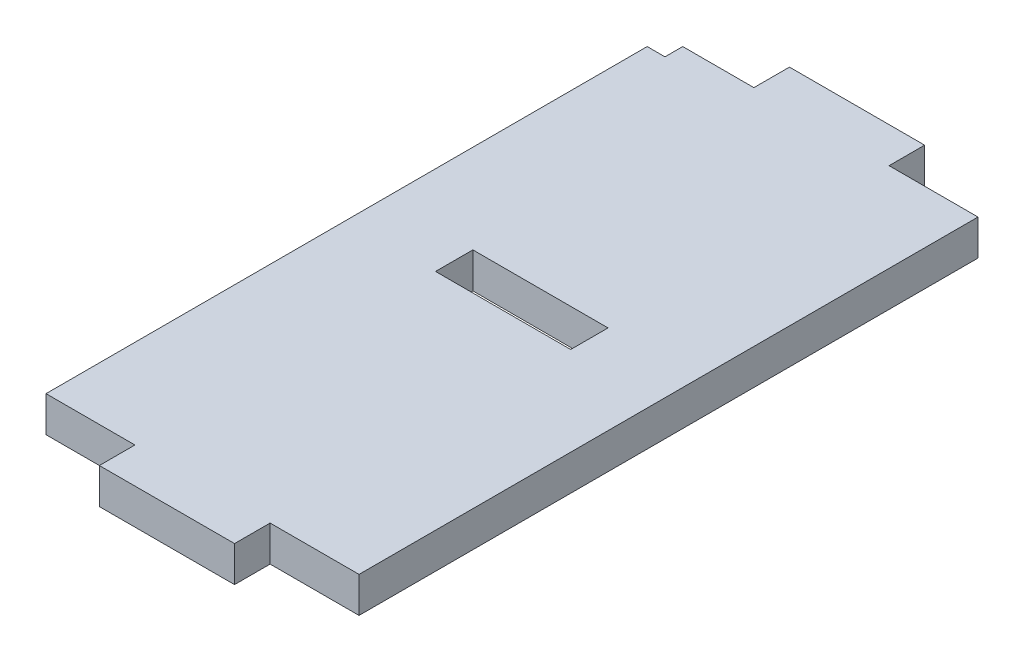
ISO-10303-21;
HEADER;
FILE_DESCRIPTION(('STEP AP214'),'2;1');
FILE_NAME('part.step','',(''),(''),'','','');
FILE_SCHEMA(('AUTOMOTIVE_DESIGN { 1 0 10303 214 1 1 1 1 }'));
ENDSEC;
DATA;
#1=APPLICATION_CONTEXT('core data for automotive mechanical design processes');
#2=APPLICATION_PROTOCOL_DEFINITION('international standard','automotive_design',2000,#1);
#3=PRODUCT_CONTEXT('',#1,'mechanical');
#4=PRODUCT('Part','Part','',(#3));
#5=PRODUCT_RELATED_PRODUCT_CATEGORY('part','',(#4));
#6=PRODUCT_DEFINITION_FORMATION('','',#4);
#7=PRODUCT_DEFINITION_CONTEXT('part definition',#1,'design');
#8=PRODUCT_DEFINITION('design','',#6,#7);
#9=PRODUCT_DEFINITION_SHAPE('','',#8);
#10=(LENGTH_UNIT() NAMED_UNIT(*) SI_UNIT(.MILLI.,.METRE.));
#11=(NAMED_UNIT(*) PLANE_ANGLE_UNIT() SI_UNIT($,.RADIAN.));
#12=(NAMED_UNIT(*) SI_UNIT($,.STERADIAN.) SOLID_ANGLE_UNIT());
#13=UNCERTAINTY_MEASURE_WITH_UNIT(LENGTH_MEASURE(1.E-05),#10,'distance_accuracy_value','');
#14=(GEOMETRIC_REPRESENTATION_CONTEXT(3) GLOBAL_UNCERTAINTY_ASSIGNED_CONTEXT((#13)) GLOBAL_UNIT_ASSIGNED_CONTEXT((#10,
#11,#12)) REPRESENTATION_CONTEXT('',''));
#15=CARTESIAN_POINT('',(0.,0.,0.));
#16=DIRECTION('',(0.,0.,1.));
#17=DIRECTION('',(1.,0.,0.));
#18=AXIS2_PLACEMENT_3D('',#15,#16,#17);
#19=CARTESIAN_POINT('',(0.,2.,-34.8));
#20=DIRECTION('',(0.,0.,-1.));
#21=DIRECTION('',(-1.,0.,0.));
#22=AXIS2_PLACEMENT_3D('',#19,#20,#21);
#23=PLANE('',#22);
#24=DIRECTION('',(1.,0.,0.));
#25=VECTOR('',#24,1.);
#26=CARTESIAN_POINT('',(0.,0.,-34.8));
#27=LINE('',#26,#25);
#28=CARTESIAN_POINT('',(1.,0.,-34.8));
#29=VERTEX_POINT('',#28);
#30=CARTESIAN_POINT('',(5.,0.,-34.8));
#31=VERTEX_POINT('',#30);
#32=EDGE_CURVE('E208',#29,#31,#27,.T.);
#33=ORIENTED_EDGE('',*,*,#32,.F.);
#34=DIRECTION('',(0.,-1.,0.));
#35=VECTOR('',#34,1.);
#36=CARTESIAN_POINT('',(1.,2.,-34.8));
#37=LINE('',#36,#35);
#38=CARTESIAN_POINT('',(1.,2.,-34.8));
#39=VERTEX_POINT('',#38);
#40=EDGE_CURVE('E11',#39,#29,#37,.T.);
#41=ORIENTED_EDGE('',*,*,#40,.F.);
#42=DIRECTION('',(1.,0.,0.));
#43=VECTOR('',#42,1.);
#44=CARTESIAN_POINT('',(0.,2.,-34.8));
#45=LINE('',#44,#43);
#46=CARTESIAN_POINT('',(5.,2.,-34.8));
#47=VERTEX_POINT('',#46);
#48=EDGE_CURVE('E321',#39,#47,#45,.T.);
#49=ORIENTED_EDGE('',*,*,#48,.T.);
#50=DIRECTION('',(0.,-1.,0.));
#51=VECTOR('',#50,1.);
#52=CARTESIAN_POINT('',(5.,2.,-34.8));
#53=LINE('',#52,#51);
#54=EDGE_CURVE('E118',#47,#31,#53,.T.);
#55=ORIENTED_EDGE('',*,*,#54,.T.);
#56=EDGE_LOOP('',(#33,#41,#49,#55));
#57=FACE_BOUND('',#56,.T.);
#58=ADVANCED_FACE('F35',(#57),#23,.T.);
#59=CARTESIAN_POINT('',(1.00000000000001,2.,0.));
#60=DIRECTION('',(1.,0.,0.));
#61=DIRECTION('',(0.,0.,-1.));
#62=AXIS2_PLACEMENT_3D('',#59,#60,#61);
#63=PLANE('',#62);
#64=DIRECTION('',(0.,0.,1.));
#65=VECTOR('',#64,1.);
#66=CARTESIAN_POINT('',(1.00000000000001,0.,0.));
#67=LINE('',#66,#65);
#68=CARTESIAN_POINT('',(1.,0.,-33.8));
#69=VERTEX_POINT('',#68);
#70=EDGE_CURVE('E211',#29,#69,#67,.T.);
#71=ORIENTED_EDGE('',*,*,#70,.T.);
#72=DIRECTION('',(0.,-1.,0.));
#73=VECTOR('',#72,1.);
#74=CARTESIAN_POINT('',(1.,2.,-33.8));
#75=LINE('',#74,#73);
#76=CARTESIAN_POINT('',(1.,2.,-33.8));
#77=VERTEX_POINT('',#76);
#78=EDGE_CURVE('E45',#77,#69,#75,.T.);
#79=ORIENTED_EDGE('',*,*,#78,.F.);
#80=DIRECTION('',(0.,0.,1.));
#81=VECTOR('',#80,1.);
#82=CARTESIAN_POINT('',(1.00000000000001,2.,0.));
#83=LINE('',#82,#81);
#84=EDGE_CURVE('E323',#39,#77,#83,.T.);
#85=ORIENTED_EDGE('',*,*,#84,.F.);
#86=ORIENTED_EDGE('',*,*,#40,.T.);
#87=EDGE_LOOP('',(#71,#79,#85,#86));
#88=FACE_BOUND('',#87,.T.);
#89=ADVANCED_FACE('F297',(#88),#63,.F.);
#90=CARTESIAN_POINT('',(0.,2.,-33.8));
#91=DIRECTION('',(0.,0.,-1.));
#92=DIRECTION('',(-1.,0.,0.));
#93=AXIS2_PLACEMENT_3D('',#90,#91,#92);
#94=PLANE('',#93);
#95=DIRECTION('',(1.,0.,0.));
#96=VECTOR('',#95,1.);
#97=CARTESIAN_POINT('',(0.,0.,-33.8));
#98=LINE('',#97,#96);
#99=CARTESIAN_POINT('',(0.,0.,-33.8));
#100=VERTEX_POINT('',#99);
#101=EDGE_CURVE('E215',#100,#69,#98,.T.);
#102=ORIENTED_EDGE('',*,*,#101,.F.);
#103=DIRECTION('',(0.,-1.,0.));
#104=VECTOR('',#103,1.);
#105=CARTESIAN_POINT('',(0.,2.,-33.8));
#106=LINE('',#105,#104);
#107=CARTESIAN_POINT('',(0.,2.,-33.8));
#108=VERTEX_POINT('',#107);
#109=EDGE_CURVE('E263',#108,#100,#106,.T.);
#110=ORIENTED_EDGE('',*,*,#109,.F.);
#111=DIRECTION('',(1.,0.,0.));
#112=VECTOR('',#111,1.);
#113=CARTESIAN_POINT('',(0.,2.,-33.8));
#114=LINE('',#113,#112);
#115=EDGE_CURVE('E325',#108,#77,#114,.T.);
#116=ORIENTED_EDGE('',*,*,#115,.T.);
#117=ORIENTED_EDGE('',*,*,#78,.T.);
#118=EDGE_LOOP('',(#102,#110,#116,#117));
#119=FACE_BOUND('',#118,.T.);
#120=ADVANCED_FACE('F303',(#119),#94,.T.);
#121=CARTESIAN_POINT('',(0.,2.,0.));
#122=DIRECTION('',(-1.,0.,0.));
#123=DIRECTION('',(0.,0.,1.));
#124=AXIS2_PLACEMENT_3D('',#121,#122,#123);
#125=PLANE('',#124);
#126=DIRECTION('',(0.,0.,-1.));
#127=VECTOR('',#126,1.);
#128=CARTESIAN_POINT('',(0.,0.,0.));
#129=LINE('',#128,#127);
#130=CARTESIAN_POINT('',(0.,0.,0.));
#131=VERTEX_POINT('',#130);
#132=EDGE_CURVE('E218',#131,#100,#129,.T.);
#133=ORIENTED_EDGE('',*,*,#132,.F.);
#134=DIRECTION('',(0.,-1.,0.));
#135=VECTOR('',#134,1.);
#136=CARTESIAN_POINT('',(0.,2.,0.));
#137=LINE('',#136,#135);
#138=CARTESIAN_POINT('',(0.,2.,0.));
#139=VERTEX_POINT('',#138);
#140=EDGE_CURVE('E261',#139,#131,#137,.T.);
#141=ORIENTED_EDGE('',*,*,#140,.F.);
#142=DIRECTION('',(0.,0.,-1.));
#143=VECTOR('',#142,1.);
#144=CARTESIAN_POINT('',(0.,2.,0.));
#145=LINE('',#144,#143);
#146=EDGE_CURVE('E344',#139,#108,#145,.T.);
#147=ORIENTED_EDGE('',*,*,#146,.T.);
#148=ORIENTED_EDGE('',*,*,#109,.T.);
#149=EDGE_LOOP('',(#133,#141,#147,#148));
#150=FACE_BOUND('',#149,.T.);
#151=ADVANCED_FACE('F355',(#150),#125,.T.);
#152=CARTESIAN_POINT('',(0.,2.,0.));
#153=DIRECTION('',(0.,0.,-1.));
#154=DIRECTION('',(-1.,0.,0.));
#155=AXIS2_PLACEMENT_3D('',#152,#153,#154);
#156=PLANE('',#155);
#157=DIRECTION('',(1.,0.,0.));
#158=VECTOR('',#157,1.);
#159=CARTESIAN_POINT('',(0.,0.,0.));
#160=LINE('',#159,#158);
#161=CARTESIAN_POINT('',(5.,0.,0.));
#162=VERTEX_POINT('',#161);
#163=EDGE_CURVE('E221',#131,#162,#160,.T.);
#164=ORIENTED_EDGE('',*,*,#163,.T.);
#165=DIRECTION('',(0.,-1.,0.));
#166=VECTOR('',#165,1.);
#167=CARTESIAN_POINT('',(5.,2.,0.));
#168=LINE('',#167,#166);
#169=CARTESIAN_POINT('',(5.,2.,0.));
#170=VERTEX_POINT('',#169);
#171=EDGE_CURVE('E258',#170,#162,#168,.T.);
#172=ORIENTED_EDGE('',*,*,#171,.F.);
#173=DIRECTION('',(1.,0.,0.));
#174=VECTOR('',#173,1.);
#175=CARTESIAN_POINT('',(0.,2.,0.));
#176=LINE('',#175,#174);
#177=EDGE_CURVE('E334',#139,#170,#176,.T.);
#178=ORIENTED_EDGE('',*,*,#177,.F.);
#179=ORIENTED_EDGE('',*,*,#140,.T.);
#180=EDGE_LOOP('',(#164,#172,#178,#179));
#181=FACE_BOUND('',#180,.T.);
#182=ADVANCED_FACE('F360',(#181),#156,.F.);
#183=CARTESIAN_POINT('',(5.,2.,0.));
#184=DIRECTION('',(1.,0.,0.));
#185=DIRECTION('',(0.,0.,-1.));
#186=AXIS2_PLACEMENT_3D('',#183,#184,#185);
#187=PLANE('',#186);
#188=DIRECTION('',(0.,0.,1.));
#189=VECTOR('',#188,1.);
#190=CARTESIAN_POINT('',(5.,0.,0.));
#191=LINE('',#190,#189);
#192=CARTESIAN_POINT('',(5.,0.,2.));
#193=VERTEX_POINT('',#192);
#194=EDGE_CURVE('E224',#162,#193,#191,.T.);
#195=ORIENTED_EDGE('',*,*,#194,.T.);
#196=DIRECTION('',(0.,-1.,0.));
#197=VECTOR('',#196,1.);
#198=CARTESIAN_POINT('',(5.,2.,2.));
#199=LINE('',#198,#197);
#200=CARTESIAN_POINT('',(5.,2.,2.));
#201=VERTEX_POINT('',#200);
#202=EDGE_CURVE('E255',#201,#193,#199,.T.);
#203=ORIENTED_EDGE('',*,*,#202,.F.);
#204=DIRECTION('',(0.,0.,1.));
#205=VECTOR('',#204,1.);
#206=CARTESIAN_POINT('',(5.,2.,0.));
#207=LINE('',#206,#205);
#208=EDGE_CURVE('E340',#170,#201,#207,.T.);
#209=ORIENTED_EDGE('',*,*,#208,.F.);
#210=ORIENTED_EDGE('',*,*,#171,.T.);
#211=EDGE_LOOP('',(#195,#203,#209,#210));
#212=FACE_BOUND('',#211,.T.);
#213=ADVANCED_FACE('F365',(#212),#187,.F.);
#214=CARTESIAN_POINT('',(0.,2.,2.));
#215=DIRECTION('',(0.,0.,-1.));
#216=DIRECTION('',(-1.,0.,0.));
#217=AXIS2_PLACEMENT_3D('',#214,#215,#216);
#218=PLANE('',#217);
#219=DIRECTION('',(1.,0.,0.));
#220=VECTOR('',#219,1.);
#221=CARTESIAN_POINT('',(0.,0.,2.));
#222=LINE('',#221,#220);
#223=CARTESIAN_POINT('',(12.6,0.,2.));
#224=VERTEX_POINT('',#223);
#225=EDGE_CURVE('E228',#193,#224,#222,.T.);
#226=ORIENTED_EDGE('',*,*,#225,.T.);
#227=DIRECTION('',(0.,-1.,0.));
#228=VECTOR('',#227,1.);
#229=CARTESIAN_POINT('',(12.6,2.,2.));
#230=LINE('',#229,#228);
#231=CARTESIAN_POINT('',(12.6,2.,2.));
#232=VERTEX_POINT('',#231);
#233=EDGE_CURVE('E253',#232,#224,#230,.T.);
#234=ORIENTED_EDGE('',*,*,#233,.F.);
#235=DIRECTION('',(1.,0.,0.));
#236=VECTOR('',#235,1.);
#237=CARTESIAN_POINT('',(0.,2.,2.));
#238=LINE('',#237,#236);
#239=EDGE_CURVE('E338',#201,#232,#238,.T.);
#240=ORIENTED_EDGE('',*,*,#239,.F.);
#241=ORIENTED_EDGE('',*,*,#202,.T.);
#242=EDGE_LOOP('',(#226,#234,#240,#241));
#243=FACE_BOUND('',#242,.T.);
#244=ADVANCED_FACE('F367',(#243),#218,.F.);
#245=CARTESIAN_POINT('',(12.6,2.,0.));
#246=DIRECTION('',(1.,0.,0.));
#247=DIRECTION('',(0.,0.,-1.));
#248=AXIS2_PLACEMENT_3D('',#245,#246,#247);
#249=PLANE('',#248);
#250=DIRECTION('',(0.,0.,1.));
#251=VECTOR('',#250,1.);
#252=CARTESIAN_POINT('',(12.6,0.,0.));
#253=LINE('',#252,#251);
#254=CARTESIAN_POINT('',(12.6,0.,0.));
#255=VERTEX_POINT('',#254);
#256=EDGE_CURVE('E231',#255,#224,#253,.T.);
#257=ORIENTED_EDGE('',*,*,#256,.F.);
#258=DIRECTION('',(0.,-1.,0.));
#259=VECTOR('',#258,1.);
#260=CARTESIAN_POINT('',(12.6,2.,0.));
#261=LINE('',#260,#259);
#262=CARTESIAN_POINT('',(12.6,2.,0.));
#263=VERTEX_POINT('',#262);
#264=EDGE_CURVE('E251',#263,#255,#261,.T.);
#265=ORIENTED_EDGE('',*,*,#264,.F.);
#266=DIRECTION('',(0.,0.,1.));
#267=VECTOR('',#266,1.);
#268=CARTESIAN_POINT('',(12.6,2.,0.));
#269=LINE('',#268,#267);
#270=EDGE_CURVE('E332',#263,#232,#269,.T.);
#271=ORIENTED_EDGE('',*,*,#270,.T.);
#272=ORIENTED_EDGE('',*,*,#233,.T.);
#273=EDGE_LOOP('',(#257,#265,#271,#272));
#274=FACE_BOUND('',#273,.T.);
#275=ADVANCED_FACE('F370',(#274),#249,.T.);
#276=CARTESIAN_POINT('',(17.6,0.,0.));
#277=VERTEX_POINT('',#276);
#278=EDGE_CURVE('E225',#255,#277,#160,.T.);
#279=ORIENTED_EDGE('',*,*,#278,.T.);
#280=DIRECTION('',(0.,-1.,0.));
#281=VECTOR('',#280,1.);
#282=CARTESIAN_POINT('',(17.6,2.,0.));
#283=LINE('',#282,#281);
#284=CARTESIAN_POINT('',(17.6,2.,0.));
#285=VERTEX_POINT('',#284);
#286=EDGE_CURVE('E248',#285,#277,#283,.T.);
#287=ORIENTED_EDGE('',*,*,#286,.F.);
#288=EDGE_CURVE('E330',#263,#285,#176,.T.);
#289=ORIENTED_EDGE('',*,*,#288,.F.);
#290=ORIENTED_EDGE('',*,*,#264,.T.);
#291=EDGE_LOOP('',(#279,#287,#289,#290));
#292=FACE_BOUND('',#291,.T.);
#293=ADVANCED_FACE('F315',(#292),#156,.F.);
#294=CARTESIAN_POINT('',(17.6,2.,0.));
#295=DIRECTION('',(-1.,0.,0.));
#296=DIRECTION('',(0.,0.,1.));
#297=AXIS2_PLACEMENT_3D('',#294,#295,#296);
#298=PLANE('',#297);
#299=DIRECTION('',(0.,0.,-1.));
#300=VECTOR('',#299,1.);
#301=CARTESIAN_POINT('',(17.6,0.,0.));
#302=LINE('',#301,#300);
#303=CARTESIAN_POINT('',(17.6,0.,-34.8));
#304=VERTEX_POINT('',#303);
#305=EDGE_CURVE('E234',#277,#304,#302,.T.);
#306=ORIENTED_EDGE('',*,*,#305,.T.);
#307=DIRECTION('',(0.,-1.,0.));
#308=VECTOR('',#307,1.);
#309=CARTESIAN_POINT('',(17.6,2.,-34.8));
#310=LINE('',#309,#308);
#311=CARTESIAN_POINT('',(17.6,2.,-34.8));
#312=VERTEX_POINT('',#311);
#313=EDGE_CURVE('E246',#312,#304,#310,.T.);
#314=ORIENTED_EDGE('',*,*,#313,.F.);
#315=DIRECTION('',(0.,0.,-1.));
#316=VECTOR('',#315,1.);
#317=CARTESIAN_POINT('',(17.6,2.,0.));
#318=LINE('',#317,#316);
#319=EDGE_CURVE('E329',#285,#312,#318,.T.);
#320=ORIENTED_EDGE('',*,*,#319,.F.);
#321=ORIENTED_EDGE('',*,*,#286,.T.);
#322=EDGE_LOOP('',(#306,#314,#320,#321));
#323=FACE_BOUND('',#322,.T.);
#324=ADVANCED_FACE('F309',(#323),#298,.F.);
#325=CARTESIAN_POINT('',(12.6,0.,-34.8));
#326=VERTEX_POINT('',#325);
#327=EDGE_CURVE('E212',#326,#304,#27,.T.);
#328=ORIENTED_EDGE('',*,*,#327,.F.);
#329=DIRECTION('',(0.,-1.,0.));
#330=VECTOR('',#329,1.);
#331=CARTESIAN_POINT('',(12.6,2.,-34.8));
#332=LINE('',#331,#330);
#333=CARTESIAN_POINT('',(12.6,2.,-34.8));
#334=VERTEX_POINT('',#333);
#335=EDGE_CURVE('E182',#334,#326,#332,.T.);
#336=ORIENTED_EDGE('',*,*,#335,.F.);
#337=EDGE_CURVE('E188',#334,#312,#45,.T.);
#338=ORIENTED_EDGE('',*,*,#337,.T.);
#339=ORIENTED_EDGE('',*,*,#313,.T.);
#340=EDGE_LOOP('',(#328,#336,#338,#339));
#341=FACE_BOUND('',#340,.T.);
#342=ADVANCED_FACE('F299',(#341),#23,.T.);
#343=CARTESIAN_POINT('',(12.6,2.,0.));
#344=DIRECTION('',(1.,0.,0.));
#345=DIRECTION('',(0.,0.,-1.));
#346=AXIS2_PLACEMENT_3D('',#343,#344,#345);
#347=PLANE('',#346);
#348=DIRECTION('',(0.,0.,1.));
#349=VECTOR('',#348,1.);
#350=CARTESIAN_POINT('',(12.6,0.,0.));
#351=LINE('',#350,#349);
#352=CARTESIAN_POINT('',(12.6,0.,-36.8));
#353=VERTEX_POINT('',#352);
#354=EDGE_CURVE('E177',#353,#326,#351,.T.);
#355=ORIENTED_EDGE('',*,*,#354,.F.);
#356=DIRECTION('',(0.,-1.,0.));
#357=VECTOR('',#356,1.);
#358=CARTESIAN_POINT('',(12.6,2.,-36.8));
#359=LINE('',#358,#357);
#360=CARTESIAN_POINT('',(12.6,2.,-36.8));
#361=VERTEX_POINT('',#360);
#362=EDGE_CURVE('E172',#361,#353,#359,.T.);
#363=ORIENTED_EDGE('',*,*,#362,.F.);
#364=DIRECTION('',(0.,0.,1.));
#365=VECTOR('',#364,1.);
#366=CARTESIAN_POINT('',(12.6,2.,0.));
#367=LINE('',#366,#365);
#368=EDGE_CURVE('E175',#361,#334,#367,.T.);
#369=ORIENTED_EDGE('',*,*,#368,.T.);
#370=ORIENTED_EDGE('',*,*,#335,.T.);
#371=EDGE_LOOP('',(#355,#363,#369,#370));
#372=FACE_BOUND('',#371,.T.);
#373=ADVANCED_FACE('F174',(#372),#347,.T.);
#374=CARTESIAN_POINT('',(0.,2.,-36.8));
#375=DIRECTION('',(0.,0.,-1.));
#376=DIRECTION('',(-1.,0.,0.));
#377=AXIS2_PLACEMENT_3D('',#374,#375,#376);
#378=PLANE('',#377);
#379=DIRECTION('',(1.,0.,0.));
#380=VECTOR('',#379,1.);
#381=CARTESIAN_POINT('',(0.,0.,-36.8));
#382=LINE('',#381,#380);
#383=CARTESIAN_POINT('',(5.,0.,-36.8));
#384=VERTEX_POINT('',#383);
#385=EDGE_CURVE('E238',#384,#353,#382,.T.);
#386=ORIENTED_EDGE('',*,*,#385,.F.);
#387=DIRECTION('',(0.,-1.,0.));
#388=VECTOR('',#387,1.);
#389=CARTESIAN_POINT('',(5.,2.,-36.8));
#390=LINE('',#389,#388);
#391=CARTESIAN_POINT('',(5.,2.,-36.8));
#392=VERTEX_POINT('',#391);
#393=EDGE_CURVE('E111',#392,#384,#390,.T.);
#394=ORIENTED_EDGE('',*,*,#393,.F.);
#395=DIRECTION('',(1.,0.,0.));
#396=VECTOR('',#395,1.);
#397=CARTESIAN_POINT('',(0.,2.,-36.8));
#398=LINE('',#397,#396);
#399=EDGE_CURVE('E186',#392,#361,#398,.T.);
#400=ORIENTED_EDGE('',*,*,#399,.T.);
#401=ORIENTED_EDGE('',*,*,#362,.T.);
#402=EDGE_LOOP('',(#386,#394,#400,#401));
#403=FACE_BOUND('',#402,.T.);
#404=ADVANCED_FACE('F190',(#403),#378,.T.);
#405=CARTESIAN_POINT('',(0.,2.,-19.));
#406=DIRECTION('',(0.,0.,-1.));
#407=DIRECTION('',(-1.,0.,0.));
#408=AXIS2_PLACEMENT_3D('',#405,#406,#407);
#409=PLANE('',#408);
#410=DIRECTION('',(1.,0.,0.));
#411=VECTOR('',#410,1.);
#412=CARTESIAN_POINT('',(0.,0.,-19.));
#413=LINE('',#412,#411);
#414=CARTESIAN_POINT('',(5.,0.,-19.));
#415=VERTEX_POINT('',#414);
#416=CARTESIAN_POINT('',(12.6,0.,-19.));
#417=VERTEX_POINT('',#416);
#418=EDGE_CURVE('E196',#415,#417,#413,.T.);
#419=ORIENTED_EDGE('',*,*,#418,.T.);
#420=DIRECTION('',(0.,-1.,0.));
#421=VECTOR('',#420,1.);
#422=CARTESIAN_POINT('',(12.6,2.,-19.));
#423=LINE('',#422,#421);
#424=CARTESIAN_POINT('',(12.6,2.,-19.));
#425=VERTEX_POINT('',#424);
#426=EDGE_CURVE('E39',#425,#417,#423,.T.);
#427=ORIENTED_EDGE('',*,*,#426,.F.);
#428=DIRECTION('',(1.,0.,0.));
#429=VECTOR('',#428,1.);
#430=CARTESIAN_POINT('',(0.,2.,-19.));
#431=LINE('',#430,#429);
#432=CARTESIAN_POINT('',(5.,2.,-19.));
#433=VERTEX_POINT('',#432);
#434=EDGE_CURVE('E242',#433,#425,#431,.T.);
#435=ORIENTED_EDGE('',*,*,#434,.F.);
#436=DIRECTION('',(0.,-1.,0.));
#437=VECTOR('',#436,1.);
#438=CARTESIAN_POINT('',(5.,2.,-19.));
#439=LINE('',#438,#437);
#440=EDGE_CURVE('E192',#433,#415,#439,.T.);
#441=ORIENTED_EDGE('',*,*,#440,.T.);
#442=EDGE_LOOP('',(#419,#427,#435,#441));
#443=FACE_BOUND('',#442,.T.);
#444=ADVANCED_FACE('F37',(#443),#409,.F.);
#445=CARTESIAN_POINT('',(12.6,2.,0.));
#446=DIRECTION('',(1.,0.,0.));
#447=DIRECTION('',(0.,0.,-1.));
#448=AXIS2_PLACEMENT_3D('',#445,#446,#447);
#449=PLANE('',#448);
#450=DIRECTION('',(0.,0.,1.));
#451=VECTOR('',#450,1.);
#452=CARTESIAN_POINT('',(12.6,0.,0.));
#453=LINE('',#452,#451);
#454=CARTESIAN_POINT('',(12.6,0.,-16.9));
#455=VERTEX_POINT('',#454);
#456=EDGE_CURVE('E199',#417,#455,#453,.T.);
#457=ORIENTED_EDGE('',*,*,#456,.T.);
#458=DIRECTION('',(0.,-1.,0.));
#459=VECTOR('',#458,1.);
#460=CARTESIAN_POINT('',(12.6,2.,-16.9));
#461=LINE('',#460,#459);
#462=CARTESIAN_POINT('',(12.6,2.,-16.9));
#463=VERTEX_POINT('',#462);
#464=EDGE_CURVE('E268',#463,#455,#461,.T.);
#465=ORIENTED_EDGE('',*,*,#464,.F.);
#466=DIRECTION('',(0.,0.,1.));
#467=VECTOR('',#466,1.);
#468=CARTESIAN_POINT('',(12.6,2.,0.));
#469=LINE('',#468,#467);
#470=EDGE_CURVE('E126',#425,#463,#469,.T.);
#471=ORIENTED_EDGE('',*,*,#470,.F.);
#472=ORIENTED_EDGE('',*,*,#426,.T.);
#473=EDGE_LOOP('',(#457,#465,#471,#472));
#474=FACE_BOUND('',#473,.T.);
#475=ADVANCED_FACE('F273',(#474),#449,.F.);
#476=CARTESIAN_POINT('',(0.,2.,-16.9));
#477=DIRECTION('',(0.,0.,-1.));
#478=DIRECTION('',(-1.,0.,0.));
#479=AXIS2_PLACEMENT_3D('',#476,#477,#478);
#480=PLANE('',#479);
#481=DIRECTION('',(1.,0.,0.));
#482=VECTOR('',#481,1.);
#483=CARTESIAN_POINT('',(0.,0.,-16.9));
#484=LINE('',#483,#482);
#485=CARTESIAN_POINT('',(5.,0.,-16.9));
#486=VERTEX_POINT('',#485);
#487=EDGE_CURVE('E202',#486,#455,#484,.T.);
#488=ORIENTED_EDGE('',*,*,#487,.F.);
#489=DIRECTION('',(0.,-1.,0.));
#490=VECTOR('',#489,1.);
#491=CARTESIAN_POINT('',(5.,2.,-16.9));
#492=LINE('',#491,#490);
#493=CARTESIAN_POINT('',(5.,2.,-16.9));
#494=VERTEX_POINT('',#493);
#495=EDGE_CURVE('E267',#494,#486,#492,.T.);
#496=ORIENTED_EDGE('',*,*,#495,.F.);
#497=DIRECTION('',(1.,0.,0.));
#498=VECTOR('',#497,1.);
#499=CARTESIAN_POINT('',(0.,2.,-16.9));
#500=LINE('',#499,#498);
#501=EDGE_CURVE('E327',#494,#463,#500,.T.);
#502=ORIENTED_EDGE('',*,*,#501,.T.);
#503=ORIENTED_EDGE('',*,*,#464,.T.);
#504=EDGE_LOOP('',(#488,#496,#502,#503));
#505=FACE_BOUND('',#504,.T.);
#506=ADVANCED_FACE('F287',(#505),#480,.T.);
#507=CARTESIAN_POINT('',(5.,2.,0.));
#508=DIRECTION('',(1.,0.,0.));
#509=DIRECTION('',(0.,0.,-1.));
#510=AXIS2_PLACEMENT_3D('',#507,#508,#509);
#511=PLANE('',#510);
#512=DIRECTION('',(0.,0.,1.));
#513=VECTOR('',#512,1.);
#514=CARTESIAN_POINT('',(5.,0.,0.));
#515=LINE('',#514,#513);
#516=EDGE_CURVE('E205',#415,#486,#515,.T.);
#517=ORIENTED_EDGE('',*,*,#516,.F.);
#518=ORIENTED_EDGE('',*,*,#440,.F.);
#519=DIRECTION('',(0.,0.,1.));
#520=VECTOR('',#519,1.);
#521=CARTESIAN_POINT('',(5.,2.,0.));
#522=LINE('',#521,#520);
#523=EDGE_CURVE('E285',#433,#494,#522,.T.);
#524=ORIENTED_EDGE('',*,*,#523,.T.);
#525=ORIENTED_EDGE('',*,*,#495,.T.);
#526=EDGE_LOOP('',(#517,#518,#524,#525));
#527=FACE_BOUND('',#526,.T.);
#528=ADVANCED_FACE('F282',(#527),#511,.T.);
#529=CARTESIAN_POINT('',(5.,2.,0.));
#530=DIRECTION('',(1.,0.,0.));
#531=DIRECTION('',(0.,0.,-1.));
#532=AXIS2_PLACEMENT_3D('',#529,#530,#531);
#533=PLANE('',#532);
#534=DIRECTION('',(0.,0.,1.));
#535=VECTOR('',#534,1.);
#536=CARTESIAN_POINT('',(5.,0.,0.));
#537=LINE('',#536,#535);
#538=EDGE_CURVE('E240',#384,#31,#537,.T.);
#539=ORIENTED_EDGE('',*,*,#538,.T.);
#540=ORIENTED_EDGE('',*,*,#54,.F.);
#541=DIRECTION('',(0.,0.,1.));
#542=VECTOR('',#541,1.);
#543=CARTESIAN_POINT('',(5.,2.,0.));
#544=LINE('',#543,#542);
#545=EDGE_CURVE('E54',#392,#47,#544,.T.);
#546=ORIENTED_EDGE('',*,*,#545,.F.);
#547=ORIENTED_EDGE('',*,*,#393,.T.);
#548=EDGE_LOOP('',(#539,#540,#546,#547));
#549=FACE_BOUND('',#548,.T.);
#550=ADVANCED_FACE('F294',(#549),#533,.F.);
#551=CARTESIAN_POINT('',(0.,2.,0.));
#552=DIRECTION('',(0.,1.,0.));
#553=DIRECTION('',(0.,0.,1.));
#554=AXIS2_PLACEMENT_3D('',#551,#552,#553);
#555=PLANE('',#554);
#556=ORIENTED_EDGE('',*,*,#434,.T.);
#557=ORIENTED_EDGE('',*,*,#470,.T.);
#558=ORIENTED_EDGE('',*,*,#501,.F.);
#559=ORIENTED_EDGE('',*,*,#523,.F.);
#560=EDGE_LOOP('',(#556,#557,#558,#559));
#561=FACE_BOUND('',#560,.T.);
#562=ORIENTED_EDGE('',*,*,#48,.F.);
#563=ORIENTED_EDGE('',*,*,#84,.T.);
#564=ORIENTED_EDGE('',*,*,#115,.F.);
#565=ORIENTED_EDGE('',*,*,#146,.F.);
#566=ORIENTED_EDGE('',*,*,#177,.T.);
#567=ORIENTED_EDGE('',*,*,#208,.T.);
#568=ORIENTED_EDGE('',*,*,#239,.T.);
#569=ORIENTED_EDGE('',*,*,#270,.F.);
#570=ORIENTED_EDGE('',*,*,#288,.T.);
#571=ORIENTED_EDGE('',*,*,#319,.T.);
#572=ORIENTED_EDGE('',*,*,#337,.F.);
#573=ORIENTED_EDGE('',*,*,#368,.F.);
#574=ORIENTED_EDGE('',*,*,#399,.F.);
#575=ORIENTED_EDGE('',*,*,#545,.T.);
#576=EDGE_LOOP('',(#562,#563,#564,#565,#566,#567,#568,#569,#570,#571,#572,#573,#574,#575));
#577=FACE_BOUND('',#576,.T.);
#578=ADVANCED_FACE('F185',(#561,#577),#555,.T.);
#579=CARTESIAN_POINT('',(0.,0.,0.));
#580=DIRECTION('',(0.,1.,0.));
#581=DIRECTION('',(0.,0.,1.));
#582=AXIS2_PLACEMENT_3D('',#579,#580,#581);
#583=PLANE('',#582);
#584=ORIENTED_EDGE('',*,*,#418,.F.);
#585=ORIENTED_EDGE('',*,*,#516,.T.);
#586=ORIENTED_EDGE('',*,*,#487,.T.);
#587=ORIENTED_EDGE('',*,*,#456,.F.);
#588=EDGE_LOOP('',(#584,#585,#586,#587));
#589=FACE_BOUND('',#588,.T.);
#590=ORIENTED_EDGE('',*,*,#32,.T.);
#591=ORIENTED_EDGE('',*,*,#538,.F.);
#592=ORIENTED_EDGE('',*,*,#385,.T.);
#593=ORIENTED_EDGE('',*,*,#354,.T.);
#594=ORIENTED_EDGE('',*,*,#327,.T.);
#595=ORIENTED_EDGE('',*,*,#305,.F.);
#596=ORIENTED_EDGE('',*,*,#278,.F.);
#597=ORIENTED_EDGE('',*,*,#256,.T.);
#598=ORIENTED_EDGE('',*,*,#225,.F.);
#599=ORIENTED_EDGE('',*,*,#194,.F.);
#600=ORIENTED_EDGE('',*,*,#163,.F.);
#601=ORIENTED_EDGE('',*,*,#132,.T.);
#602=ORIENTED_EDGE('',*,*,#101,.T.);
#603=ORIENTED_EDGE('',*,*,#70,.F.);
#604=EDGE_LOOP('',(#590,#591,#592,#593,#594,#595,#596,#597,#598,#599,#600,#601,#602,#603));
#605=FACE_BOUND('',#604,.T.);
#606=ADVANCED_FACE('F279',(#589,#605),#583,.F.);
#607=CLOSED_SHELL('',(#58,#89,#120,#151,#182,#213,#244,#275,#293,#324,#342,#373,#404,#444,#475,
#506,#528,#550,#578,#606));
#608=MANIFOLD_SOLID_BREP('B2',#607);
#609=ADVANCED_BREP_SHAPE_REPRESENTATION('',(#18,#608),#14);
#610=SHAPE_DEFINITION_REPRESENTATION(#9,#609);
ENDSEC;
END-ISO-10303-21;
